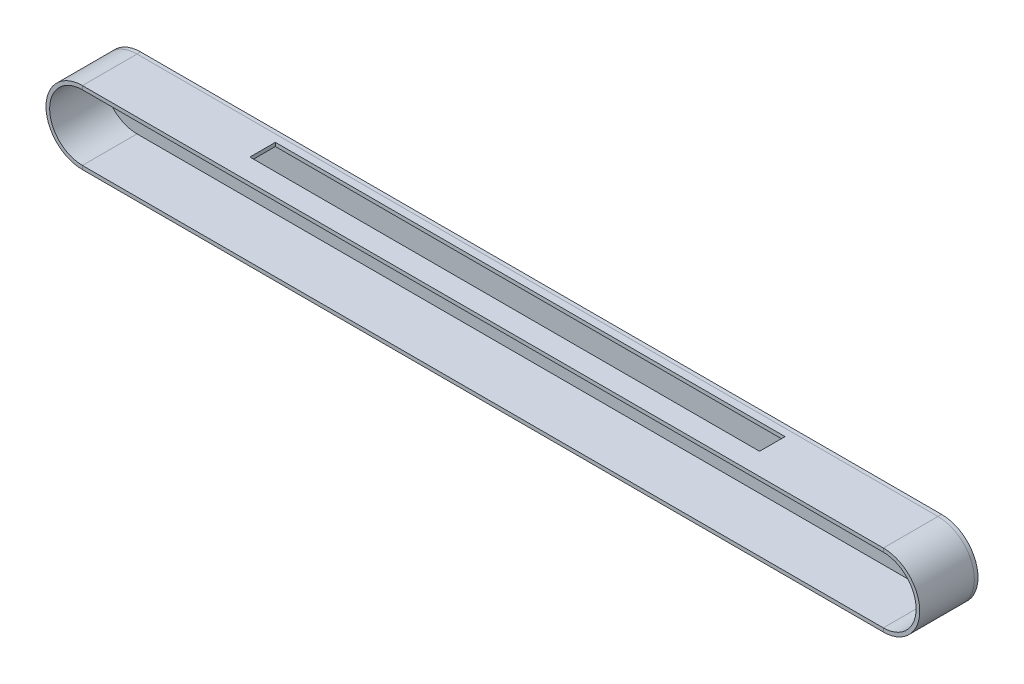
ISO-10303-21;
HEADER;
FILE_DESCRIPTION(('STEP AP214'),'2;1');
FILE_NAME('part.step','',(''),(''),'','','');
FILE_SCHEMA(('AUTOMOTIVE_DESIGN { 1 0 10303 214 1 1 1 1 }'));
ENDSEC;
DATA;
#1=APPLICATION_CONTEXT('core data for automotive mechanical design processes');
#2=APPLICATION_PROTOCOL_DEFINITION('international standard','automotive_design',2000,#1);
#3=PRODUCT_CONTEXT('',#1,'mechanical');
#4=PRODUCT('Part','Part','',(#3));
#5=PRODUCT_RELATED_PRODUCT_CATEGORY('part','',(#4));
#6=PRODUCT_DEFINITION_FORMATION('','',#4);
#7=PRODUCT_DEFINITION_CONTEXT('part definition',#1,'design');
#8=PRODUCT_DEFINITION('design','',#6,#7);
#9=PRODUCT_DEFINITION_SHAPE('','',#8);
#10=(LENGTH_UNIT() NAMED_UNIT(*) SI_UNIT(.MILLI.,.METRE.));
#11=(NAMED_UNIT(*) PLANE_ANGLE_UNIT() SI_UNIT($,.RADIAN.));
#12=(NAMED_UNIT(*) SI_UNIT($,.STERADIAN.) SOLID_ANGLE_UNIT());
#13=UNCERTAINTY_MEASURE_WITH_UNIT(LENGTH_MEASURE(1.E-05),#10,'distance_accuracy_value','');
#14=(GEOMETRIC_REPRESENTATION_CONTEXT(3) GLOBAL_UNCERTAINTY_ASSIGNED_CONTEXT((#13)) GLOBAL_UNIT_ASSIGNED_CONTEXT((#10,
#11,#12)) REPRESENTATION_CONTEXT('',''));
#15=CARTESIAN_POINT('',(0.,0.,0.));
#16=DIRECTION('',(0.,0.,1.));
#17=DIRECTION('',(1.,0.,0.));
#18=AXIS2_PLACEMENT_3D('',#15,#16,#17);
#19=CARTESIAN_POINT('',(-502.733741957931,0.,0.));
#20=DIRECTION('',(0.,0.,1.));
#21=DIRECTION('',(1.,0.,0.));
#22=AXIS2_PLACEMENT_3D('',#19,#20,#21);
#23=PLANE('',#22);
#24=DIRECTION('',(-1.,0.,0.));
#25=VECTOR('',#24,1.);
#26=CARTESIAN_POINT('',(-502.733741957931,25.,0.));
#27=LINE('',#26,#25);
#28=CARTESIAN_POINT('',(-352.733741957931,25.,0.));
#29=VERTEX_POINT('',#28);
#30=CARTESIAN_POINT('',(-452.733741957932,25.,0.));
#31=VERTEX_POINT('',#30);
#32=EDGE_CURVE('E214',#29,#31,#27,.T.);
#33=ORIENTED_EDGE('',*,*,#32,.T.);
#34=DIRECTION('',(0.,-1.,0.));
#35=VECTOR('',#34,1.);
#36=CARTESIAN_POINT('',(-452.733741957932,0.,0.));
#37=LINE('',#36,#35);
#38=CARTESIAN_POINT('',(-452.733741957932,-25.,0.));
#39=VERTEX_POINT('',#38);
#40=EDGE_CURVE('E217',#31,#39,#37,.T.);
#41=ORIENTED_EDGE('',*,*,#40,.T.);
#42=DIRECTION('',(1.,0.,0.));
#43=VECTOR('',#42,1.);
#44=CARTESIAN_POINT('',(-502.733741957931,-25.,0.));
#45=LINE('',#44,#43);
#46=CARTESIAN_POINT('',(-352.733741957931,-25.,0.));
#47=VERTEX_POINT('',#46);
#48=EDGE_CURVE('E211',#39,#47,#45,.T.);
#49=ORIENTED_EDGE('',*,*,#48,.T.);
#50=DIRECTION('',(0.,1.,0.));
#51=VECTOR('',#50,1.);
#52=CARTESIAN_POINT('',(-352.733741957931,0.,0.));
#53=LINE('',#52,#51);
#54=EDGE_CURVE('E156',#47,#29,#53,.T.);
#55=ORIENTED_EDGE('',*,*,#54,.T.);
#56=EDGE_LOOP('',(#33,#41,#49,#55));
#57=FACE_BOUND('',#56,.T.);
#58=DIRECTION('',(-1.,0.,0.));
#59=VECTOR('',#58,1.);
#60=CARTESIAN_POINT('',(-502.733741957931,25.0000000000004,0.));
#61=LINE('',#60,#59);
#62=CARTESIAN_POINT('',(547.266258042068,25.,0.));
#63=VERTEX_POINT('',#62);
#64=CARTESIAN_POINT('',(447.266258042068,25.,0.));
#65=VERTEX_POINT('',#64);
#66=EDGE_CURVE('E205',#63,#65,#61,.T.);
#67=ORIENTED_EDGE('',*,*,#66,.T.);
#68=DIRECTION('',(0.,-1.,0.));
#69=VECTOR('',#68,1.);
#70=CARTESIAN_POINT('',(447.266258042068,0.,0.));
#71=LINE('',#70,#69);
#72=CARTESIAN_POINT('',(447.266258042068,-25.,0.));
#73=VERTEX_POINT('',#72);
#74=EDGE_CURVE('E208',#65,#73,#71,.T.);
#75=ORIENTED_EDGE('',*,*,#74,.T.);
#76=DIRECTION('',(1.,0.,0.));
#77=VECTOR('',#76,1.);
#78=CARTESIAN_POINT('',(-502.733741957931,-25.,0.));
#79=LINE('',#78,#77);
#80=CARTESIAN_POINT('',(547.266258042068,-25.,0.));
#81=VERTEX_POINT('',#80);
#82=EDGE_CURVE('E179',#73,#81,#79,.T.);
#83=ORIENTED_EDGE('',*,*,#82,.T.);
#84=DIRECTION('',(0.,1.,0.));
#85=VECTOR('',#84,1.);
#86=CARTESIAN_POINT('',(547.266258042068,0.,0.));
#87=LINE('',#86,#85);
#88=EDGE_CURVE('E202',#81,#63,#87,.T.);
#89=ORIENTED_EDGE('',*,*,#88,.T.);
#90=EDGE_LOOP('',(#67,#75,#83,#89));
#91=FACE_BOUND('',#90,.T.);
#92=CARTESIAN_POINT('',(-502.733741957931,0.,0.));
#93=DIRECTION('',(0.,0.,1.));
#94=DIRECTION('',(1.,0.,0.));
#95=AXIS2_PLACEMENT_3D('',#92,#93,#94);
#96=CIRCLE('',#95,50.);
#97=CARTESIAN_POINT('',(-502.733741957931,50.,0.));
#98=VERTEX_POINT('',#97);
#99=CARTESIAN_POINT('',(-502.733741957931,-50.,0.));
#100=VERTEX_POINT('',#99);
#101=EDGE_CURVE('E241',#98,#100,#96,.T.);
#102=ORIENTED_EDGE('',*,*,#101,.F.);
#103=DIRECTION('',(-1.,0.,0.));
#104=VECTOR('',#103,1.);
#105=CARTESIAN_POINT('',(-502.733741957931,50.,0.));
#106=LINE('',#105,#104);
#107=CARTESIAN_POINT('',(597.266258042068,50.,0.));
#108=VERTEX_POINT('',#107);
#109=EDGE_CURVE('E226',#108,#98,#106,.T.);
#110=ORIENTED_EDGE('',*,*,#109,.F.);
#111=CARTESIAN_POINT('',(597.266258042068,0.,0.));
#112=DIRECTION('',(0.,0.,1.));
#113=DIRECTION('',(1.,0.,0.));
#114=AXIS2_PLACEMENT_3D('',#111,#112,#113);
#115=CIRCLE('',#114,50.);
#116=CARTESIAN_POINT('',(597.266258042068,-50.,0.));
#117=VERTEX_POINT('',#116);
#118=EDGE_CURVE('E235',#117,#108,#115,.T.);
#119=ORIENTED_EDGE('',*,*,#118,.F.);
#120=DIRECTION('',(1.,0.,0.));
#121=VECTOR('',#120,1.);
#122=CARTESIAN_POINT('',(-502.733741957931,-50.,0.));
#123=LINE('',#122,#121);
#124=EDGE_CURVE('E13',#100,#117,#123,.T.);
#125=ORIENTED_EDGE('',*,*,#124,.F.);
#126=EDGE_LOOP('',(#102,#110,#119,#125));
#127=FACE_BOUND('',#126,.T.);
#128=ADVANCED_FACE('F61',(#57,#91,#127),#23,.F.);
#129=CARTESIAN_POINT('',(-502.733741957931,-50.,80.));
#130=DIRECTION('',(0.,1.,0.));
#131=DIRECTION('',(0.,0.,1.));
#132=AXIS2_PLACEMENT_3D('',#129,#130,#131);
#133=PLANE('',#132);
#134=DIRECTION('',(0.,0.,-1.));
#135=VECTOR('',#134,1.);
#136=CARTESIAN_POINT('',(597.266258042068,-50.,80.));
#137=LINE('',#136,#135);
#138=CARTESIAN_POINT('',(597.266258042068,-50.,5.));
#139=VERTEX_POINT('',#138);
#140=EDGE_CURVE('E236',#139,#117,#137,.T.);
#141=ORIENTED_EDGE('',*,*,#140,.F.);
#142=DIRECTION('',(-1.,0.,0.));
#143=VECTOR('',#142,1.);
#144=CARTESIAN_POINT('',(-502.733741957931,-50.,5.));
#145=LINE('',#144,#143);
#146=CARTESIAN_POINT('',(-502.733741957931,-50.,5.));
#147=VERTEX_POINT('',#146);
#148=EDGE_CURVE('E232',#139,#147,#145,.T.);
#149=ORIENTED_EDGE('',*,*,#148,.T.);
#150=DIRECTION('',(0.,0.,-1.));
#151=VECTOR('',#150,1.);
#152=CARTESIAN_POINT('',(-502.733741957931,-50.,80.));
#153=LINE('',#152,#151);
#154=EDGE_CURVE('E239',#147,#100,#153,.T.);
#155=ORIENTED_EDGE('',*,*,#154,.T.);
#156=ORIENTED_EDGE('',*,*,#124,.T.);
#157=EDGE_LOOP('',(#141,#149,#155,#156));
#158=FACE_BOUND('',#157,.T.);
#159=ADVANCED_FACE('F251',(#158),#133,.F.);
#160=CARTESIAN_POINT('',(-502.733741957931,0.,80.));
#161=DIRECTION('',(0.,0.,-1.));
#162=DIRECTION('',(-1.,0.,0.));
#163=AXIS2_PLACEMENT_3D('',#160,#161,#162);
#164=CYLINDRICAL_SURFACE('',#163,50.);
#165=CARTESIAN_POINT('',(-502.733741957931,0.,5.));
#166=DIRECTION('',(0.,0.,1.));
#167=DIRECTION('',(1.,0.,0.));
#168=AXIS2_PLACEMENT_3D('',#165,#166,#167);
#169=CIRCLE('',#168,50.);
#170=CARTESIAN_POINT('',(-502.733741957931,50.,5.));
#171=VERTEX_POINT('',#170);
#172=EDGE_CURVE('E65',#171,#147,#169,.T.);
#173=ORIENTED_EDGE('',*,*,#172,.F.);
#174=DIRECTION('',(0.,0.,-1.));
#175=VECTOR('',#174,1.);
#176=CARTESIAN_POINT('',(-502.733741957931,50.,80.));
#177=LINE('',#176,#175);
#178=EDGE_CURVE('E223',#171,#98,#177,.T.);
#179=ORIENTED_EDGE('',*,*,#178,.T.);
#180=ORIENTED_EDGE('',*,*,#101,.T.);
#181=ORIENTED_EDGE('',*,*,#154,.F.);
#182=EDGE_LOOP('',(#173,#179,#180,#181));
#183=FACE_BOUND('',#182,.T.);
#184=ADVANCED_FACE('F254',(#183),#164,.T.);
#185=CARTESIAN_POINT('',(597.266258042068,0.,80.));
#186=DIRECTION('',(0.,0.,-1.));
#187=DIRECTION('',(-1.,0.,0.));
#188=AXIS2_PLACEMENT_3D('',#185,#186,#187);
#189=CYLINDRICAL_SURFACE('',#188,50.);
#190=ORIENTED_EDGE('',*,*,#118,.T.);
#191=DIRECTION('',(0.,0.,-1.));
#192=VECTOR('',#191,1.);
#193=CARTESIAN_POINT('',(597.266258042068,50.,80.));
#194=LINE('',#193,#192);
#195=CARTESIAN_POINT('',(597.266258042068,50.,5.));
#196=VERTEX_POINT('',#195);
#197=EDGE_CURVE('E220',#196,#108,#194,.T.);
#198=ORIENTED_EDGE('',*,*,#197,.F.);
#199=CARTESIAN_POINT('',(597.266258042068,0.,5.));
#200=DIRECTION('',(0.,0.,1.));
#201=DIRECTION('',(1.,0.,0.));
#202=AXIS2_PLACEMENT_3D('',#199,#200,#201);
#203=CIRCLE('',#202,50.);
#204=EDGE_CURVE('E238',#139,#196,#203,.T.);
#205=ORIENTED_EDGE('',*,*,#204,.F.);
#206=ORIENTED_EDGE('',*,*,#140,.T.);
#207=EDGE_LOOP('',(#190,#198,#205,#206));
#208=FACE_BOUND('',#207,.T.);
#209=ADVANCED_FACE('F256',(#208),#189,.T.);
#210=CARTESIAN_POINT('',(597.266258042068,-45.,5.));
#211=DIRECTION('',(0.,0.,1.));
#212=DIRECTION('',(1.,0.,0.));
#213=AXIS2_PLACEMENT_3D('',#210,#211,#212);
#214=PLANE('',#213);
#215=DIRECTION('',(0.,-1.,0.));
#216=VECTOR('',#215,1.);
#217=CARTESIAN_POINT('',(-452.733741957932,25.,5.));
#218=LINE('',#217,#216);
#219=CARTESIAN_POINT('',(-452.733741957932,25.,5.));
#220=VERTEX_POINT('',#219);
#221=CARTESIAN_POINT('',(-452.733741957931,-25.,5.));
#222=VERTEX_POINT('',#221);
#223=EDGE_CURVE('E168',#220,#222,#218,.T.);
#224=ORIENTED_EDGE('',*,*,#223,.F.);
#225=DIRECTION('',(-1.,0.,0.));
#226=VECTOR('',#225,1.);
#227=CARTESIAN_POINT('',(-452.733741957932,25.,5.));
#228=LINE('',#227,#226);
#229=CARTESIAN_POINT('',(-352.733741957931,25.,5.));
#230=VERTEX_POINT('',#229);
#231=EDGE_CURVE('E172',#230,#220,#228,.T.);
#232=ORIENTED_EDGE('',*,*,#231,.F.);
#233=DIRECTION('',(0.,1.,0.));
#234=VECTOR('',#233,1.);
#235=CARTESIAN_POINT('',(-352.733741957931,25.,5.));
#236=LINE('',#235,#234);
#237=CARTESIAN_POINT('',(-352.733741957931,-25.,5.));
#238=VERTEX_POINT('',#237);
#239=EDGE_CURVE('E153',#238,#230,#236,.T.);
#240=ORIENTED_EDGE('',*,*,#239,.F.);
#241=DIRECTION('',(1.,0.,0.));
#242=VECTOR('',#241,1.);
#243=CARTESIAN_POINT('',(-452.733741957932,-25.,5.));
#244=LINE('',#243,#242);
#245=EDGE_CURVE('E163',#222,#238,#244,.T.);
#246=ORIENTED_EDGE('',*,*,#245,.F.);
#247=EDGE_LOOP('',(#224,#232,#240,#246));
#248=FACE_BOUND('',#247,.T.);
#249=DIRECTION('',(0.,-1.,0.));
#250=VECTOR('',#249,1.);
#251=CARTESIAN_POINT('',(447.266258042068,25.,5.));
#252=LINE('',#251,#250);
#253=CARTESIAN_POINT('',(447.266258042068,25.,5.));
#254=VERTEX_POINT('',#253);
#255=CARTESIAN_POINT('',(447.266258042068,-25.,5.));
#256=VERTEX_POINT('',#255);
#257=EDGE_CURVE('E182',#254,#256,#252,.T.);
#258=ORIENTED_EDGE('',*,*,#257,.F.);
#259=DIRECTION('',(-1.,0.,0.));
#260=VECTOR('',#259,1.);
#261=CARTESIAN_POINT('',(447.266258042068,25.,5.));
#262=LINE('',#261,#260);
#263=CARTESIAN_POINT('',(547.266258042068,25.,5.));
#264=VERTEX_POINT('',#263);
#265=EDGE_CURVE('E189',#264,#254,#262,.T.);
#266=ORIENTED_EDGE('',*,*,#265,.F.);
#267=DIRECTION('',(0.,1.,0.));
#268=VECTOR('',#267,1.);
#269=CARTESIAN_POINT('',(547.266258042068,25.,5.));
#270=LINE('',#269,#268);
#271=CARTESIAN_POINT('',(547.266258042068,-25.,5.));
#272=VERTEX_POINT('',#271);
#273=EDGE_CURVE('E186',#272,#264,#270,.T.);
#274=ORIENTED_EDGE('',*,*,#273,.F.);
#275=DIRECTION('',(1.,0.,0.));
#276=VECTOR('',#275,1.);
#277=CARTESIAN_POINT('',(447.266258042068,-25.,5.));
#278=LINE('',#277,#276);
#279=EDGE_CURVE('E184',#256,#272,#278,.T.);
#280=ORIENTED_EDGE('',*,*,#279,.F.);
#281=EDGE_LOOP('',(#258,#266,#274,#280));
#282=FACE_BOUND('',#281,.T.);
#283=ORIENTED_EDGE('',*,*,#204,.T.);
#284=DIRECTION('',(1.,0.,0.));
#285=VECTOR('',#284,1.);
#286=CARTESIAN_POINT('',(-502.733741957931,50.,5.));
#287=LINE('',#286,#285);
#288=EDGE_CURVE('E229',#171,#196,#287,.T.);
#289=ORIENTED_EDGE('',*,*,#288,.F.);
#290=ORIENTED_EDGE('',*,*,#172,.T.);
#291=ORIENTED_EDGE('',*,*,#148,.F.);
#292=EDGE_LOOP('',(#283,#289,#290,#291));
#293=FACE_BOUND('',#292,.T.);
#294=ADVANCED_FACE('F63',(#248,#282,#293),#214,.T.);
#295=CARTESIAN_POINT('',(-502.733741957931,50.,80.));
#296=DIRECTION('',(0.,-1.,0.));
#297=DIRECTION('',(0.,0.,-1.));
#298=AXIS2_PLACEMENT_3D('',#295,#296,#297);
#299=PLANE('',#298);
#300=ORIENTED_EDGE('',*,*,#178,.F.);
#301=ORIENTED_EDGE('',*,*,#288,.T.);
#302=ORIENTED_EDGE('',*,*,#197,.T.);
#303=ORIENTED_EDGE('',*,*,#109,.T.);
#304=EDGE_LOOP('',(#300,#301,#302,#303));
#305=FACE_BOUND('',#304,.T.);
#306=ADVANCED_FACE('F274',(#305),#299,.F.);
#307=CARTESIAN_POINT('',(447.266258042068,25.,-5.));
#308=DIRECTION('',(-1.,0.,0.));
#309=DIRECTION('',(0.,0.,1.));
#310=AXIS2_PLACEMENT_3D('',#307,#308,#309);
#311=PLANE('',#310);
#312=DIRECTION('',(0.,0.,1.));
#313=VECTOR('',#312,1.);
#314=CARTESIAN_POINT('',(447.266258042068,25.,-5.));
#315=LINE('',#314,#313);
#316=EDGE_CURVE('E193',#65,#254,#315,.T.);
#317=ORIENTED_EDGE('',*,*,#316,.T.);
#318=ORIENTED_EDGE('',*,*,#257,.T.);
#319=DIRECTION('',(0.,0.,1.));
#320=VECTOR('',#319,1.);
#321=CARTESIAN_POINT('',(447.266258042068,-25.,-5.));
#322=LINE('',#321,#320);
#323=EDGE_CURVE('E192',#73,#256,#322,.T.);
#324=ORIENTED_EDGE('',*,*,#323,.F.);
#325=ORIENTED_EDGE('',*,*,#74,.F.);
#326=EDGE_LOOP('',(#317,#318,#324,#325));
#327=FACE_BOUND('',#326,.T.);
#328=ADVANCED_FACE('F277',(#327),#311,.F.);
#329=CARTESIAN_POINT('',(447.266258042068,25.,-5.));
#330=DIRECTION('',(0.,1.,0.));
#331=DIRECTION('',(-1.,0.,0.));
#332=AXIS2_PLACEMENT_3D('',#329,#330,#331);
#333=PLANE('',#332);
#334=DIRECTION('',(0.,0.,1.));
#335=VECTOR('',#334,1.);
#336=CARTESIAN_POINT('',(547.266258042068,25.,-5.));
#337=LINE('',#336,#335);
#338=EDGE_CURVE('E195',#63,#264,#337,.T.);
#339=ORIENTED_EDGE('',*,*,#338,.T.);
#340=ORIENTED_EDGE('',*,*,#265,.T.);
#341=ORIENTED_EDGE('',*,*,#316,.F.);
#342=ORIENTED_EDGE('',*,*,#66,.F.);
#343=EDGE_LOOP('',(#339,#340,#341,#342));
#344=FACE_BOUND('',#343,.T.);
#345=ADVANCED_FACE('F283',(#344),#333,.F.);
#346=CARTESIAN_POINT('',(547.266258042068,25.,-5.));
#347=DIRECTION('',(1.,0.,0.));
#348=DIRECTION('',(0.,0.,-1.));
#349=AXIS2_PLACEMENT_3D('',#346,#347,#348);
#350=PLANE('',#349);
#351=DIRECTION('',(0.,0.,1.));
#352=VECTOR('',#351,1.);
#353=CARTESIAN_POINT('',(547.266258042068,-25.,-5.));
#354=LINE('',#353,#352);
#355=EDGE_CURVE('E85',#81,#272,#354,.T.);
#356=ORIENTED_EDGE('',*,*,#355,.T.);
#357=ORIENTED_EDGE('',*,*,#273,.T.);
#358=ORIENTED_EDGE('',*,*,#338,.F.);
#359=ORIENTED_EDGE('',*,*,#88,.F.);
#360=EDGE_LOOP('',(#356,#357,#358,#359));
#361=FACE_BOUND('',#360,.T.);
#362=ADVANCED_FACE('F291',(#361),#350,.F.);
#363=CARTESIAN_POINT('',(447.266258042068,-25.,-5.));
#364=DIRECTION('',(0.,-1.,0.));
#365=DIRECTION('',(0.,0.,-1.));
#366=AXIS2_PLACEMENT_3D('',#363,#364,#365);
#367=PLANE('',#366);
#368=ORIENTED_EDGE('',*,*,#323,.T.);
#369=ORIENTED_EDGE('',*,*,#279,.T.);
#370=ORIENTED_EDGE('',*,*,#355,.F.);
#371=ORIENTED_EDGE('',*,*,#82,.F.);
#372=EDGE_LOOP('',(#368,#369,#370,#371));
#373=FACE_BOUND('',#372,.T.);
#374=ADVANCED_FACE('F287',(#373),#367,.F.);
#375=CARTESIAN_POINT('',(-452.733741957932,25.,-5.));
#376=DIRECTION('',(-1.,0.,0.));
#377=DIRECTION('',(0.,0.,1.));
#378=AXIS2_PLACEMENT_3D('',#375,#376,#377);
#379=PLANE('',#378);
#380=DIRECTION('',(0.,0.,1.));
#381=VECTOR('',#380,1.);
#382=CARTESIAN_POINT('',(-452.733741957932,25.,-5.));
#383=LINE('',#382,#381);
#384=EDGE_CURVE('E177',#31,#220,#383,.T.);
#385=ORIENTED_EDGE('',*,*,#384,.T.);
#386=ORIENTED_EDGE('',*,*,#223,.T.);
#387=DIRECTION('',(0.,0.,1.));
#388=VECTOR('',#387,1.);
#389=CARTESIAN_POINT('',(-452.733741957932,-25.,-5.));
#390=LINE('',#389,#388);
#391=EDGE_CURVE('E159',#39,#222,#390,.T.);
#392=ORIENTED_EDGE('',*,*,#391,.F.);
#393=ORIENTED_EDGE('',*,*,#40,.F.);
#394=EDGE_LOOP('',(#385,#386,#392,#393));
#395=FACE_BOUND('',#394,.T.);
#396=ADVANCED_FACE('F290',(#395),#379,.F.);
#397=CARTESIAN_POINT('',(-452.733741957932,25.,-5.));
#398=DIRECTION('',(0.,1.,0.));
#399=DIRECTION('',(0.,0.,1.));
#400=AXIS2_PLACEMENT_3D('',#397,#398,#399);
#401=PLANE('',#400);
#402=DIRECTION('',(0.,0.,1.));
#403=VECTOR('',#402,1.);
#404=CARTESIAN_POINT('',(-352.733741957931,25.,-5.));
#405=LINE('',#404,#403);
#406=EDGE_CURVE('E158',#29,#230,#405,.T.);
#407=ORIENTED_EDGE('',*,*,#406,.T.);
#408=ORIENTED_EDGE('',*,*,#231,.T.);
#409=ORIENTED_EDGE('',*,*,#384,.F.);
#410=ORIENTED_EDGE('',*,*,#32,.F.);
#411=EDGE_LOOP('',(#407,#408,#409,#410));
#412=FACE_BOUND('',#411,.T.);
#413=ADVANCED_FACE('F300',(#412),#401,.F.);
#414=CARTESIAN_POINT('',(-352.733741957931,25.,-5.));
#415=DIRECTION('',(1.,0.,0.));
#416=DIRECTION('',(0.,0.,-1.));
#417=AXIS2_PLACEMENT_3D('',#414,#415,#416);
#418=PLANE('',#417);
#419=DIRECTION('',(0.,0.,1.));
#420=VECTOR('',#419,1.);
#421=CARTESIAN_POINT('',(-352.733741957931,-25.,-5.));
#422=LINE('',#421,#420);
#423=EDGE_CURVE('E77',#47,#238,#422,.T.);
#424=ORIENTED_EDGE('',*,*,#423,.T.);
#425=ORIENTED_EDGE('',*,*,#239,.T.);
#426=ORIENTED_EDGE('',*,*,#406,.F.);
#427=ORIENTED_EDGE('',*,*,#54,.F.);
#428=EDGE_LOOP('',(#424,#425,#426,#427));
#429=FACE_BOUND('',#428,.T.);
#430=ADVANCED_FACE('F150',(#429),#418,.F.);
#431=CARTESIAN_POINT('',(-452.733741957932,-25.,-5.));
#432=DIRECTION('',(0.,-1.,0.));
#433=DIRECTION('',(0.,0.,-1.));
#434=AXIS2_PLACEMENT_3D('',#431,#432,#433);
#435=PLANE('',#434);
#436=ORIENTED_EDGE('',*,*,#391,.T.);
#437=ORIENTED_EDGE('',*,*,#245,.T.);
#438=ORIENTED_EDGE('',*,*,#423,.F.);
#439=ORIENTED_EDGE('',*,*,#48,.F.);
#440=EDGE_LOOP('',(#436,#437,#438,#439));
#441=FACE_BOUND('',#440,.T.);
#442=ADVANCED_FACE('F164',(#441),#435,.F.);
#443=CLOSED_SHELL('',(#128,#159,#184,#209,#294,#306,#328,#345,#362,#374,#396,#413,#430,#442));
#444=MANIFOLD_SOLID_BREP('B2',#443);
#445=CARTESIAN_POINT('',(0.,0.,5.));
#446=DIRECTION('',(0.,0.,-1.));
#447=DIRECTION('',(-1.,0.,0.));
#448=AXIS2_PLACEMENT_3D('',#445,#446,#447);
#449=PLANE('',#448);
#450=DIRECTION('',(-1.,0.,0.));
#451=VECTOR('',#450,1.);
#452=CARTESIAN_POINT('',(-502.733741957931,-50.,5.));
#453=LINE('',#452,#451);
#454=CARTESIAN_POINT('',(597.266258042068,-50.,5.));
#455=VERTEX_POINT('',#454);
#456=CARTESIAN_POINT('',(-502.733741957931,-50.,5.));
#457=VERTEX_POINT('',#456);
#458=EDGE_CURVE('E481',#455,#457,#453,.T.);
#459=ORIENTED_EDGE('',*,*,#458,.T.);
#460=DIRECTION('',(0.,1.,0.));
#461=VECTOR('',#460,1.);
#462=CARTESIAN_POINT('',(-502.733741957931,0.,5.));
#463=LINE('',#462,#461);
#464=CARTESIAN_POINT('',(-502.733741957931,-45.,5.));
#465=VERTEX_POINT('',#464);
#466=EDGE_CURVE('E438',#457,#465,#463,.T.);
#467=ORIENTED_EDGE('',*,*,#466,.T.);
#468=DIRECTION('',(-1.,0.,0.));
#469=VECTOR('',#468,1.);
#470=CARTESIAN_POINT('',(-502.733741957931,-45.,5.));
#471=LINE('',#470,#469);
#472=CARTESIAN_POINT('',(597.266258042068,-45.,5.));
#473=VERTEX_POINT('',#472);
#474=EDGE_CURVE('E489',#473,#465,#471,.T.);
#475=ORIENTED_EDGE('',*,*,#474,.F.);
#476=DIRECTION('',(0.,1.,0.));
#477=VECTOR('',#476,1.);
#478=CARTESIAN_POINT('',(597.266258042068,0.,5.));
#479=LINE('',#478,#477);
#480=EDGE_CURVE('E488',#455,#473,#479,.T.);
#481=ORIENTED_EDGE('',*,*,#480,.F.);
#482=EDGE_LOOP('',(#459,#467,#475,#481));
#483=FACE_BOUND('',#482,.T.);
#484=ADVANCED_FACE('F434',(#483),#449,.T.);
#485=CARTESIAN_POINT('',(-502.733741957931,-50.,80.));
#486=DIRECTION('',(0.,1.,0.));
#487=DIRECTION('',(0.,0.,1.));
#488=AXIS2_PLACEMENT_3D('',#485,#486,#487);
#489=PLANE('',#488);
#490=ORIENTED_EDGE('',*,*,#458,.F.);
#491=DIRECTION('',(0.,0.,-1.));
#492=VECTOR('',#491,1.);
#493=CARTESIAN_POINT('',(597.266258042068,-50.,80.));
#494=LINE('',#493,#492);
#495=CARTESIAN_POINT('',(597.266258042068,-50.,80.));
#496=VERTEX_POINT('',#495);
#497=EDGE_CURVE('E59',#496,#455,#494,.T.);
#498=ORIENTED_EDGE('',*,*,#497,.F.);
#499=DIRECTION('',(1.,0.,0.));
#500=VECTOR('',#499,1.);
#501=CARTESIAN_POINT('',(-502.733741957931,-50.,80.));
#502=LINE('',#501,#500);
#503=CARTESIAN_POINT('',(-502.733741957931,-50.,80.));
#504=VERTEX_POINT('',#503);
#505=EDGE_CURVE('E451',#504,#496,#502,.T.);
#506=ORIENTED_EDGE('',*,*,#505,.F.);
#507=DIRECTION('',(0.,0.,-1.));
#508=VECTOR('',#507,1.);
#509=CARTESIAN_POINT('',(-502.733741957931,-50.,80.));
#510=LINE('',#509,#508);
#511=EDGE_CURVE('E477',#504,#457,#510,.T.);
#512=ORIENTED_EDGE('',*,*,#511,.T.);
#513=EDGE_LOOP('',(#490,#498,#506,#512));
#514=FACE_BOUND('',#513,.T.);
#515=ADVANCED_FACE('F479',(#514),#489,.F.);
#516=CARTESIAN_POINT('',(-502.733741957931,0.,80.));
#517=DIRECTION('',(0.,0.,1.));
#518=DIRECTION('',(1.,0.,0.));
#519=AXIS2_PLACEMENT_3D('',#516,#517,#518);
#520=PLANE('',#519);
#521=DIRECTION('',(0.,1.,0.));
#522=VECTOR('',#521,1.);
#523=CARTESIAN_POINT('',(-502.733741957931,0.,80.));
#524=LINE('',#523,#522);
#525=CARTESIAN_POINT('',(-502.733741957931,-45.,80.));
#526=VERTEX_POINT('',#525);
#527=EDGE_CURVE('E456',#504,#526,#524,.T.);
#528=ORIENTED_EDGE('',*,*,#527,.F.);
#529=ORIENTED_EDGE('',*,*,#505,.T.);
#530=DIRECTION('',(0.,1.,0.));
#531=VECTOR('',#530,1.);
#532=CARTESIAN_POINT('',(597.266258042068,0.,80.));
#533=LINE('',#532,#531);
#534=CARTESIAN_POINT('',(597.266258042068,-45.,80.));
#535=VERTEX_POINT('',#534);
#536=EDGE_CURVE('E443',#496,#535,#533,.T.);
#537=ORIENTED_EDGE('',*,*,#536,.T.);
#538=DIRECTION('',(1.,0.,0.));
#539=VECTOR('',#538,1.);
#540=CARTESIAN_POINT('',(-502.733741957931,-45.,80.));
#541=LINE('',#540,#539);
#542=EDGE_CURVE('E502',#526,#535,#541,.T.);
#543=ORIENTED_EDGE('',*,*,#542,.F.);
#544=EDGE_LOOP('',(#528,#529,#537,#543));
#545=FACE_BOUND('',#544,.T.);
#546=ADVANCED_FACE('F506',(#545),#520,.T.);
#547=CARTESIAN_POINT('',(-502.733741957931,0.,0.));
#548=DIRECTION('',(1.,0.,0.));
#549=DIRECTION('',(0.,0.,-1.));
#550=AXIS2_PLACEMENT_3D('',#547,#548,#549);
#551=PLANE('',#550);
#552=ORIENTED_EDGE('',*,*,#466,.F.);
#553=ORIENTED_EDGE('',*,*,#511,.F.);
#554=ORIENTED_EDGE('',*,*,#527,.T.);
#555=DIRECTION('',(0.,0.,1.));
#556=VECTOR('',#555,1.);
#557=CARTESIAN_POINT('',(-502.733741957931,-45.,80.));
#558=LINE('',#557,#556);
#559=EDGE_CURVE('E491',#526,#465,#558,.F.);
#560=ORIENTED_EDGE('',*,*,#559,.T.);
#561=EDGE_LOOP('',(#552,#553,#554,#560));
#562=FACE_BOUND('',#561,.T.);
#563=ADVANCED_FACE('F490',(#562),#551,.F.);
#564=CARTESIAN_POINT('',(597.266258042068,0.,0.));
#565=DIRECTION('',(1.,0.,0.));
#566=DIRECTION('',(0.,0.,-1.));
#567=AXIS2_PLACEMENT_3D('',#564,#565,#566);
#568=PLANE('',#567);
#569=ORIENTED_EDGE('',*,*,#497,.T.);
#570=ORIENTED_EDGE('',*,*,#480,.T.);
#571=DIRECTION('',(0.,0.,-1.));
#572=VECTOR('',#571,1.);
#573=CARTESIAN_POINT('',(597.266258042068,-45.,80.));
#574=LINE('',#573,#572);
#575=EDGE_CURVE('E497',#535,#473,#574,.T.);
#576=ORIENTED_EDGE('',*,*,#575,.F.);
#577=ORIENTED_EDGE('',*,*,#536,.F.);
#578=EDGE_LOOP('',(#569,#570,#576,#577));
#579=FACE_BOUND('',#578,.T.);
#580=ADVANCED_FACE('F508',(#579),#568,.T.);
#581=CARTESIAN_POINT('',(-502.733741957931,-45.,80.));
#582=DIRECTION('',(0.,1.,0.));
#583=DIRECTION('',(0.,0.,1.));
#584=AXIS2_PLACEMENT_3D('',#581,#582,#583);
#585=PLANE('',#584);
#586=ORIENTED_EDGE('',*,*,#575,.T.);
#587=ORIENTED_EDGE('',*,*,#474,.T.);
#588=ORIENTED_EDGE('',*,*,#559,.F.);
#589=ORIENTED_EDGE('',*,*,#542,.T.);
#590=EDGE_LOOP('',(#586,#587,#588,#589));
#591=FACE_BOUND('',#590,.T.);
#592=ADVANCED_FACE('F436',(#591),#585,.T.);
#593=CLOSED_SHELL('',(#484,#515,#546,#563,#580,#592));
#594=MANIFOLD_SOLID_BREP('B7',#593);
#595=CARTESIAN_POINT('',(0.,0.,5.));
#596=DIRECTION('',(0.,0.,-1.));
#597=DIRECTION('',(-1.,0.,0.));
#598=AXIS2_PLACEMENT_3D('',#595,#596,#597);
#599=PLANE('',#598);
#600=DIRECTION('',(1.,0.,0.));
#601=VECTOR('',#600,1.);
#602=CARTESIAN_POINT('',(597.266258042068,45.,5.));
#603=LINE('',#602,#601);
#604=CARTESIAN_POINT('',(-502.733741957931,45.,5.));
#605=VERTEX_POINT('',#604);
#606=CARTESIAN_POINT('',(597.266258042068,45.,5.));
#607=VERTEX_POINT('',#606);
#608=EDGE_CURVE('E695',#605,#607,#603,.T.);
#609=ORIENTED_EDGE('',*,*,#608,.F.);
#610=DIRECTION('',(0.,1.,0.));
#611=VECTOR('',#610,1.);
#612=CARTESIAN_POINT('',(-502.733741957931,0.,5.));
#613=LINE('',#612,#611);
#614=CARTESIAN_POINT('',(-502.733741957931,50.,5.));
#615=VERTEX_POINT('',#614);
#616=EDGE_CURVE('E579',#605,#615,#613,.T.);
#617=ORIENTED_EDGE('',*,*,#616,.T.);
#618=DIRECTION('',(1.,0.,0.));
#619=VECTOR('',#618,1.);
#620=CARTESIAN_POINT('',(-502.733741957931,50.,5.));
#621=LINE('',#620,#619);
#622=CARTESIAN_POINT('',(597.266258042068,50.,5.));
#623=VERTEX_POINT('',#622);
#624=EDGE_CURVE('E698',#615,#623,#621,.T.);
#625=ORIENTED_EDGE('',*,*,#624,.T.);
#626=DIRECTION('',(0.,1.,0.));
#627=VECTOR('',#626,1.);
#628=CARTESIAN_POINT('',(597.266258042068,0.,5.));
#629=LINE('',#628,#627);
#630=EDGE_CURVE('E432',#607,#623,#629,.T.);
#631=ORIENTED_EDGE('',*,*,#630,.F.);
#632=EDGE_LOOP('',(#609,#617,#625,#631));
#633=FACE_BOUND('',#632,.T.);
#634=ADVANCED_FACE('F575',(#633),#599,.T.);
#635=CARTESIAN_POINT('',(597.266258042068,45.,5.));
#636=DIRECTION('',(0.,-1.,0.));
#637=DIRECTION('',(0.,0.,-1.));
#638=AXIS2_PLACEMENT_3D('',#635,#636,#637);
#639=PLANE('',#638);
#640=DIRECTION('',(0.,0.,-1.));
#641=VECTOR('',#640,1.);
#642=CARTESIAN_POINT('',(-302.733741957932,45.,5.));
#643=LINE('',#642,#641);
#644=CARTESIAN_POINT('',(-302.733741957931,45.,50.));
#645=VERTEX_POINT('',#644);
#646=CARTESIAN_POINT('',(-302.733741957931,45.,15.));
#647=VERTEX_POINT('',#646);
#648=EDGE_CURVE('E673',#645,#647,#643,.T.);
#649=ORIENTED_EDGE('',*,*,#648,.F.);
#650=DIRECTION('',(-1.,0.,0.));
#651=VECTOR('',#650,1.);
#652=CARTESIAN_POINT('',(597.266258042068,45.,50.));
#653=LINE('',#652,#651);
#654=CARTESIAN_POINT('',(397.266258042068,45.,50.));
#655=VERTEX_POINT('',#654);
#656=EDGE_CURVE('E666',#655,#645,#653,.T.);
#657=ORIENTED_EDGE('',*,*,#656,.F.);
#658=DIRECTION('',(0.,0.,1.));
#659=VECTOR('',#658,1.);
#660=CARTESIAN_POINT('',(397.266258042068,45.,5.));
#661=LINE('',#660,#659);
#662=CARTESIAN_POINT('',(397.266258042068,45.,15.));
#663=VERTEX_POINT('',#662);
#664=EDGE_CURVE('E647',#663,#655,#661,.T.);
#665=ORIENTED_EDGE('',*,*,#664,.F.);
#666=DIRECTION('',(1.,0.,0.));
#667=VECTOR('',#666,1.);
#668=CARTESIAN_POINT('',(597.266258042068,45.,15.));
#669=LINE('',#668,#667);
#670=EDGE_CURVE('E671',#647,#663,#669,.T.);
#671=ORIENTED_EDGE('',*,*,#670,.F.);
#672=EDGE_LOOP('',(#649,#657,#665,#671));
#673=FACE_BOUND('',#672,.T.);
#674=DIRECTION('',(0.,0.,-1.));
#675=VECTOR('',#674,1.);
#676=CARTESIAN_POINT('',(-502.733741957931,45.,80.));
#677=LINE('',#676,#675);
#678=CARTESIAN_POINT('',(-502.733741957931,45.,80.));
#679=VERTEX_POINT('',#678);
#680=EDGE_CURVE('E688',#679,#605,#677,.T.);
#681=ORIENTED_EDGE('',*,*,#680,.T.);
#682=ORIENTED_EDGE('',*,*,#608,.T.);
#683=DIRECTION('',(0.,0.,-1.));
#684=VECTOR('',#683,1.);
#685=CARTESIAN_POINT('',(597.266258042068,45.,80.));
#686=LINE('',#685,#684);
#687=CARTESIAN_POINT('',(597.266258042068,45.,80.));
#688=VERTEX_POINT('',#687);
#689=EDGE_CURVE('E679',#688,#607,#686,.T.);
#690=ORIENTED_EDGE('',*,*,#689,.F.);
#691=DIRECTION('',(-1.,0.,0.));
#692=VECTOR('',#691,1.);
#693=CARTESIAN_POINT('',(-502.733741957931,45.,80.));
#694=LINE('',#693,#692);
#695=EDGE_CURVE('E683',#688,#679,#694,.T.);
#696=ORIENTED_EDGE('',*,*,#695,.T.);
#697=EDGE_LOOP('',(#681,#682,#690,#696));
#698=FACE_BOUND('',#697,.T.);
#699=ADVANCED_FACE('F716',(#673,#698),#639,.T.);
#700=CARTESIAN_POINT('',(597.266258042068,0.,0.));
#701=DIRECTION('',(1.,0.,0.));
#702=DIRECTION('',(0.,0.,-1.));
#703=AXIS2_PLACEMENT_3D('',#700,#701,#702);
#704=PLANE('',#703);
#705=ORIENTED_EDGE('',*,*,#689,.T.);
#706=ORIENTED_EDGE('',*,*,#630,.T.);
#707=DIRECTION('',(0.,0.,-1.));
#708=VECTOR('',#707,1.);
#709=CARTESIAN_POINT('',(597.266258042068,50.,80.));
#710=LINE('',#709,#708);
#711=CARTESIAN_POINT('',(597.266258042068,50.,80.));
#712=VERTEX_POINT('',#711);
#713=EDGE_CURVE('E678',#712,#623,#710,.T.);
#714=ORIENTED_EDGE('',*,*,#713,.F.);
#715=DIRECTION('',(0.,1.,0.));
#716=VECTOR('',#715,1.);
#717=CARTESIAN_POINT('',(597.266258042068,0.,80.));
#718=LINE('',#717,#716);
#719=EDGE_CURVE('E675',#688,#712,#718,.T.);
#720=ORIENTED_EDGE('',*,*,#719,.F.);
#721=EDGE_LOOP('',(#705,#706,#714,#720));
#722=FACE_BOUND('',#721,.T.);
#723=ADVANCED_FACE('F711',(#722),#704,.T.);
#724=CARTESIAN_POINT('',(-502.733741957931,0.,80.));
#725=DIRECTION('',(0.,0.,1.));
#726=DIRECTION('',(1.,0.,0.));
#727=AXIS2_PLACEMENT_3D('',#724,#725,#726);
#728=PLANE('',#727);
#729=DIRECTION('',(0.,1.,0.));
#730=VECTOR('',#729,1.);
#731=CARTESIAN_POINT('',(-502.733741957931,0.,80.));
#732=LINE('',#731,#730);
#733=CARTESIAN_POINT('',(-502.733741957931,50.,80.));
#734=VERTEX_POINT('',#733);
#735=EDGE_CURVE('E680',#679,#734,#732,.T.);
#736=ORIENTED_EDGE('',*,*,#735,.F.);
#737=ORIENTED_EDGE('',*,*,#695,.F.);
#738=ORIENTED_EDGE('',*,*,#719,.T.);
#739=DIRECTION('',(-1.,0.,0.));
#740=VECTOR('',#739,1.);
#741=CARTESIAN_POINT('',(-502.733741957931,50.,80.));
#742=LINE('',#741,#740);
#743=EDGE_CURVE('E685',#712,#734,#742,.T.);
#744=ORIENTED_EDGE('',*,*,#743,.T.);
#745=EDGE_LOOP('',(#736,#737,#738,#744));
#746=FACE_BOUND('',#745,.T.);
#747=ADVANCED_FACE('F714',(#746),#728,.T.);
#748=CARTESIAN_POINT('',(-502.733741957931,0.,0.));
#749=DIRECTION('',(1.,0.,0.));
#750=DIRECTION('',(0.,0.,-1.));
#751=AXIS2_PLACEMENT_3D('',#748,#749,#750);
#752=PLANE('',#751);
#753=ORIENTED_EDGE('',*,*,#616,.F.);
#754=ORIENTED_EDGE('',*,*,#680,.F.);
#755=ORIENTED_EDGE('',*,*,#735,.T.);
#756=DIRECTION('',(0.,0.,-1.));
#757=VECTOR('',#756,1.);
#758=CARTESIAN_POINT('',(-502.733741957931,50.,80.));
#759=LINE('',#758,#757);
#760=EDGE_CURVE('E584',#734,#615,#759,.T.);
#761=ORIENTED_EDGE('',*,*,#760,.T.);
#762=EDGE_LOOP('',(#753,#754,#755,#761));
#763=FACE_BOUND('',#762,.T.);
#764=ADVANCED_FACE('F707',(#763),#752,.F.);
#765=CARTESIAN_POINT('',(-502.733741957931,50.,80.));
#766=DIRECTION('',(0.,-1.,0.));
#767=DIRECTION('',(0.,0.,-1.));
#768=AXIS2_PLACEMENT_3D('',#765,#766,#767);
#769=PLANE('',#768);
#770=DIRECTION('',(1.,0.,0.));
#771=VECTOR('',#770,1.);
#772=CARTESIAN_POINT('',(-302.733741957931,50.,50.));
#773=LINE('',#772,#771);
#774=CARTESIAN_POINT('',(-302.733741957931,50.,50.));
#775=VERTEX_POINT('',#774);
#776=CARTESIAN_POINT('',(397.266258042068,50.,50.));
#777=VERTEX_POINT('',#776);
#778=EDGE_CURVE('E653',#775,#777,#773,.T.);
#779=ORIENTED_EDGE('',*,*,#778,.F.);
#780=DIRECTION('',(0.,0.,1.));
#781=VECTOR('',#780,1.);
#782=CARTESIAN_POINT('',(-302.733741957931,50.,15.));
#783=LINE('',#782,#781);
#784=CARTESIAN_POINT('',(-302.733741957931,50.,15.));
#785=VERTEX_POINT('',#784);
#786=EDGE_CURVE('E600',#785,#775,#783,.T.);
#787=ORIENTED_EDGE('',*,*,#786,.F.);
#788=DIRECTION('',(-1.,0.,0.));
#789=VECTOR('',#788,1.);
#790=CARTESIAN_POINT('',(-302.733741957931,50.,15.));
#791=LINE('',#790,#789);
#792=CARTESIAN_POINT('',(397.266258042068,50.,15.));
#793=VERTEX_POINT('',#792);
#794=EDGE_CURVE('E659',#793,#785,#791,.T.);
#795=ORIENTED_EDGE('',*,*,#794,.F.);
#796=DIRECTION('',(0.,0.,-1.));
#797=VECTOR('',#796,1.);
#798=CARTESIAN_POINT('',(397.266258042068,50.,15.));
#799=LINE('',#798,#797);
#800=EDGE_CURVE('E644',#777,#793,#799,.T.);
#801=ORIENTED_EDGE('',*,*,#800,.F.);
#802=EDGE_LOOP('',(#779,#787,#795,#801));
#803=FACE_BOUND('',#802,.T.);
#804=ORIENTED_EDGE('',*,*,#624,.F.);
#805=ORIENTED_EDGE('',*,*,#760,.F.);
#806=ORIENTED_EDGE('',*,*,#743,.F.);
#807=ORIENTED_EDGE('',*,*,#713,.T.);
#808=EDGE_LOOP('',(#804,#805,#806,#807));
#809=FACE_BOUND('',#808,.T.);
#810=ADVANCED_FACE('F577',(#803,#809),#769,.F.);
#811=CARTESIAN_POINT('',(-302.733741957931,40.,15.));
#812=DIRECTION('',(-1.,0.,0.));
#813=DIRECTION('',(0.,0.,1.));
#814=AXIS2_PLACEMENT_3D('',#811,#812,#813);
#815=PLANE('',#814);
#816=ORIENTED_EDGE('',*,*,#648,.T.);
#817=DIRECTION('',(0.,1.,0.));
#818=VECTOR('',#817,1.);
#819=CARTESIAN_POINT('',(-302.733741957931,40.,15.));
#820=LINE('',#819,#818);
#821=EDGE_CURVE('E664',#647,#785,#820,.T.);
#822=ORIENTED_EDGE('',*,*,#821,.T.);
#823=ORIENTED_EDGE('',*,*,#786,.T.);
#824=DIRECTION('',(0.,1.,0.));
#825=VECTOR('',#824,1.);
#826=CARTESIAN_POINT('',(-302.733741957931,40.,50.));
#827=LINE('',#826,#825);
#828=EDGE_CURVE('E650',#645,#775,#827,.T.);
#829=ORIENTED_EDGE('',*,*,#828,.F.);
#830=EDGE_LOOP('',(#816,#822,#823,#829));
#831=FACE_BOUND('',#830,.T.);
#832=ADVANCED_FACE('F725',(#831),#815,.F.);
#833=CARTESIAN_POINT('',(-302.733741957931,40.,15.));
#834=DIRECTION('',(0.,0.,-1.));
#835=DIRECTION('',(-1.,0.,0.));
#836=AXIS2_PLACEMENT_3D('',#833,#834,#835);
#837=PLANE('',#836);
#838=ORIENTED_EDGE('',*,*,#670,.T.);
#839=DIRECTION('',(0.,1.,0.));
#840=VECTOR('',#839,1.);
#841=CARTESIAN_POINT('',(397.266258042068,40.,15.));
#842=LINE('',#841,#840);
#843=EDGE_CURVE('E649',#663,#793,#842,.T.);
#844=ORIENTED_EDGE('',*,*,#843,.T.);
#845=ORIENTED_EDGE('',*,*,#794,.T.);
#846=ORIENTED_EDGE('',*,*,#821,.F.);
#847=EDGE_LOOP('',(#838,#844,#845,#846));
#848=FACE_BOUND('',#847,.T.);
#849=ADVANCED_FACE('F734',(#848),#837,.F.);
#850=CARTESIAN_POINT('',(397.266258042068,40.,15.));
#851=DIRECTION('',(1.,0.,0.));
#852=DIRECTION('',(0.,0.,-1.));
#853=AXIS2_PLACEMENT_3D('',#850,#851,#852);
#854=PLANE('',#853);
#855=ORIENTED_EDGE('',*,*,#664,.T.);
#856=DIRECTION('',(0.,1.,0.));
#857=VECTOR('',#856,1.);
#858=CARTESIAN_POINT('',(397.266258042068,40.,50.));
#859=LINE('',#858,#857);
#860=EDGE_CURVE('E592',#655,#777,#859,.T.);
#861=ORIENTED_EDGE('',*,*,#860,.T.);
#862=ORIENTED_EDGE('',*,*,#800,.T.);
#863=ORIENTED_EDGE('',*,*,#843,.F.);
#864=EDGE_LOOP('',(#855,#861,#862,#863));
#865=FACE_BOUND('',#864,.T.);
#866=ADVANCED_FACE('F641',(#865),#854,.F.);
#867=CARTESIAN_POINT('',(-302.733741957931,40.,50.));
#868=DIRECTION('',(0.,0.,1.));
#869=DIRECTION('',(1.,0.,0.));
#870=AXIS2_PLACEMENT_3D('',#867,#868,#869);
#871=PLANE('',#870);
#872=ORIENTED_EDGE('',*,*,#656,.T.);
#873=ORIENTED_EDGE('',*,*,#828,.T.);
#874=ORIENTED_EDGE('',*,*,#778,.T.);
#875=ORIENTED_EDGE('',*,*,#860,.F.);
#876=EDGE_LOOP('',(#872,#873,#874,#875));
#877=FACE_BOUND('',#876,.T.);
#878=ADVANCED_FACE('F654',(#877),#871,.F.);
#879=CLOSED_SHELL('',(#634,#699,#723,#747,#764,#810,#832,#849,#866,#878));
#880=MANIFOLD_SOLID_BREP('B53',#879);
#881=CARTESIAN_POINT('',(-502.733741957931,-45.,5.));
#882=DIRECTION('',(0.,0.,1.));
#883=DIRECTION('',(1.,0.,0.));
#884=AXIS2_PLACEMENT_3D('',#881,#882,#883);
#885=PLANE('',#884);
#886=DIRECTION('',(0.,-1.,0.));
#887=VECTOR('',#886,1.);
#888=CARTESIAN_POINT('',(-502.733741957931,0.,5.));
#889=LINE('',#888,#887);
#890=CARTESIAN_POINT('',(-502.733741957931,50.,5.));
#891=VERTEX_POINT('',#890);
#892=CARTESIAN_POINT('',(-502.733741957931,45.,5.));
#893=VERTEX_POINT('',#892);
#894=EDGE_CURVE('E885',#891,#893,#889,.T.);
#895=ORIENTED_EDGE('',*,*,#894,.T.);
#896=CARTESIAN_POINT('',(-502.733741957931,0.,5.));
#897=DIRECTION('',(0.,0.,1.));
#898=DIRECTION('',(1.,0.,0.));
#899=AXIS2_PLACEMENT_3D('',#896,#897,#898);
#900=CIRCLE('',#899,45.);
#901=CARTESIAN_POINT('',(-502.733741957931,-45.,5.));
#902=VERTEX_POINT('',#901);
#903=EDGE_CURVE('E573',#893,#902,#900,.T.);
#904=ORIENTED_EDGE('',*,*,#903,.T.);
#905=CARTESIAN_POINT('',(-502.733741957931,-50.,5.));
#906=VERTEX_POINT('',#905);
#907=EDGE_CURVE('E830',#902,#906,#889,.T.);
#908=ORIENTED_EDGE('',*,*,#907,.T.);
#909=CARTESIAN_POINT('',(-502.733741957931,0.,5.));
#910=DIRECTION('',(0.,0.,1.));
#911=DIRECTION('',(1.,0.,0.));
#912=AXIS2_PLACEMENT_3D('',#909,#910,#911);
#913=CIRCLE('',#912,50.);
#914=EDGE_CURVE('E825',#891,#906,#913,.T.);
#915=ORIENTED_EDGE('',*,*,#914,.F.);
#916=EDGE_LOOP('',(#895,#904,#908,#915));
#917=FACE_BOUND('',#916,.T.);
#918=ADVANCED_FACE('F822',(#917),#885,.F.);
#919=CARTESIAN_POINT('',(-502.733741957931,0.,0.));
#920=DIRECTION('',(1.,0.,0.));
#921=DIRECTION('',(0.,0.,-1.));
#922=AXIS2_PLACEMENT_3D('',#919,#920,#921);
#923=PLANE('',#922);
#924=ORIENTED_EDGE('',*,*,#907,.F.);
#925=DIRECTION('',(0.,0.,1.));
#926=VECTOR('',#925,1.);
#927=CARTESIAN_POINT('',(-502.733741957931,-45.,80.));
#928=LINE('',#927,#926);
#929=CARTESIAN_POINT('',(-502.733741957931,-45.,80.));
#930=VERTEX_POINT('',#929);
#931=EDGE_CURVE('E875',#930,#902,#928,.F.);
#932=ORIENTED_EDGE('',*,*,#931,.F.);
#933=DIRECTION('',(0.,1.,0.));
#934=VECTOR('',#933,1.);
#935=CARTESIAN_POINT('',(-502.733741957931,0.,80.));
#936=LINE('',#935,#934);
#937=CARTESIAN_POINT('',(-502.733741957931,-50.,80.));
#938=VERTEX_POINT('',#937);
#939=EDGE_CURVE('E867',#938,#930,#936,.T.);
#940=ORIENTED_EDGE('',*,*,#939,.F.);
#941=DIRECTION('',(0.,0.,-1.));
#942=VECTOR('',#941,1.);
#943=CARTESIAN_POINT('',(-502.733741957931,-50.,80.));
#944=LINE('',#943,#942);
#945=EDGE_CURVE('E878',#938,#906,#944,.T.);
#946=ORIENTED_EDGE('',*,*,#945,.T.);
#947=EDGE_LOOP('',(#924,#932,#940,#946));
#948=FACE_BOUND('',#947,.T.);
#949=ADVANCED_FACE('F877',(#948),#923,.T.);
#950=CARTESIAN_POINT('',(-502.733741957931,0.,80.));
#951=DIRECTION('',(0.,0.,1.));
#952=DIRECTION('',(1.,0.,0.));
#953=AXIS2_PLACEMENT_3D('',#950,#951,#952);
#954=PLANE('',#953);
#955=CARTESIAN_POINT('',(-502.733741957931,0.,80.));
#956=DIRECTION('',(0.,0.,1.));
#957=DIRECTION('',(1.,0.,0.));
#958=AXIS2_PLACEMENT_3D('',#955,#956,#957);
#959=CIRCLE('',#958,50.);
#960=CARTESIAN_POINT('',(-502.733741957931,50.,80.));
#961=VERTEX_POINT('',#960);
#962=EDGE_CURVE('E864',#961,#938,#959,.T.);
#963=ORIENTED_EDGE('',*,*,#962,.T.);
#964=ORIENTED_EDGE('',*,*,#939,.T.);
#965=CARTESIAN_POINT('',(-502.733741957931,0.,80.));
#966=DIRECTION('',(0.,0.,1.));
#967=DIRECTION('',(1.,0.,0.));
#968=AXIS2_PLACEMENT_3D('',#965,#966,#967);
#969=CIRCLE('',#968,45.);
#970=CARTESIAN_POINT('',(-502.733741957931,45.,80.));
#971=VERTEX_POINT('',#970);
#972=EDGE_CURVE('E891',#971,#930,#969,.T.);
#973=ORIENTED_EDGE('',*,*,#972,.F.);
#974=EDGE_CURVE('E870',#971,#961,#936,.T.);
#975=ORIENTED_EDGE('',*,*,#974,.T.);
#976=EDGE_LOOP('',(#963,#964,#973,#975));
#977=FACE_BOUND('',#976,.T.);
#978=ADVANCED_FACE('F866',(#977),#954,.T.);
#979=ORIENTED_EDGE('',*,*,#894,.F.);
#980=DIRECTION('',(0.,0.,-1.));
#981=VECTOR('',#980,1.);
#982=CARTESIAN_POINT('',(-502.733741957931,50.,80.));
#983=LINE('',#982,#981);
#984=EDGE_CURVE('E874',#961,#891,#983,.T.);
#985=ORIENTED_EDGE('',*,*,#984,.F.);
#986=ORIENTED_EDGE('',*,*,#974,.F.);
#987=DIRECTION('',(0.,0.,-1.));
#988=VECTOR('',#987,1.);
#989=CARTESIAN_POINT('',(-502.733741957931,45.,80.));
#990=LINE('',#989,#988);
#991=EDGE_CURVE('E879',#971,#893,#990,.T.);
#992=ORIENTED_EDGE('',*,*,#991,.T.);
#993=EDGE_LOOP('',(#979,#985,#986,#992));
#994=FACE_BOUND('',#993,.T.);
#995=ADVANCED_FACE('F894',(#994),#923,.T.);
#996=CARTESIAN_POINT('',(-502.733741957931,0.,80.));
#997=DIRECTION('',(0.,0.,-1.));
#998=DIRECTION('',(-1.,0.,0.));
#999=AXIS2_PLACEMENT_3D('',#996,#997,#998);
#1000=CYLINDRICAL_SURFACE('',#999,45.);
#1001=ORIENTED_EDGE('',*,*,#903,.F.);
#1002=ORIENTED_EDGE('',*,*,#991,.F.);
#1003=ORIENTED_EDGE('',*,*,#972,.T.);
#1004=ORIENTED_EDGE('',*,*,#931,.T.);
#1005=EDGE_LOOP('',(#1001,#1002,#1003,#1004));
#1006=FACE_BOUND('',#1005,.T.);
#1007=ADVANCED_FACE('F892',(#1006),#1000,.F.);
#1008=CARTESIAN_POINT('',(-502.733741957931,0.,80.));
#1009=DIRECTION('',(0.,0.,-1.));
#1010=DIRECTION('',(-1.,0.,0.));
#1011=AXIS2_PLACEMENT_3D('',#1008,#1009,#1010);
#1012=CYLINDRICAL_SURFACE('',#1011,50.);
#1013=ORIENTED_EDGE('',*,*,#984,.T.);
#1014=ORIENTED_EDGE('',*,*,#914,.T.);
#1015=ORIENTED_EDGE('',*,*,#945,.F.);
#1016=ORIENTED_EDGE('',*,*,#962,.F.);
#1017=EDGE_LOOP('',(#1013,#1014,#1015,#1016));
#1018=FACE_BOUND('',#1017,.T.);
#1019=ADVANCED_FACE('F881',(#1018),#1012,.T.);
#1020=CLOSED_SHELL('',(#918,#949,#978,#995,#1007,#1019));
#1021=MANIFOLD_SOLID_BREP('B426',#1020);
#1022=CARTESIAN_POINT('',(597.266258042068,-45.,5.));
#1023=DIRECTION('',(0.,0.,1.));
#1024=DIRECTION('',(1.,0.,0.));
#1025=AXIS2_PLACEMENT_3D('',#1022,#1023,#1024);
#1026=PLANE('',#1025);
#1027=CARTESIAN_POINT('',(597.266258042068,0.,5.));
#1028=DIRECTION('',(0.,0.,1.));
#1029=DIRECTION('',(1.,0.,0.));
#1030=AXIS2_PLACEMENT_3D('',#1027,#1028,#1029);
#1031=CIRCLE('',#1030,50.);
#1032=CARTESIAN_POINT('',(597.266258042068,-50.,5.));
#1033=VERTEX_POINT('',#1032);
#1034=CARTESIAN_POINT('',(597.266258042068,50.,5.));
#1035=VERTEX_POINT('',#1034);
#1036=EDGE_CURVE('E946',#1033,#1035,#1031,.T.);
#1037=ORIENTED_EDGE('',*,*,#1036,.F.);
#1038=DIRECTION('',(0.,-1.,0.));
#1039=VECTOR('',#1038,1.);
#1040=CARTESIAN_POINT('',(597.266258042068,0.,5.));
#1041=LINE('',#1040,#1039);
#1042=CARTESIAN_POINT('',(597.266258042068,-45.,5.));
#1043=VERTEX_POINT('',#1042);
#1044=EDGE_CURVE('E989',#1043,#1033,#1041,.T.);
#1045=ORIENTED_EDGE('',*,*,#1044,.F.);
#1046=CARTESIAN_POINT('',(597.266258042068,0.,5.));
#1047=DIRECTION('',(0.,0.,1.));
#1048=DIRECTION('',(1.,0.,0.));
#1049=AXIS2_PLACEMENT_3D('',#1046,#1047,#1048);
#1050=CIRCLE('',#1049,45.);
#1051=CARTESIAN_POINT('',(597.266258042068,45.,5.));
#1052=VERTEX_POINT('',#1051);
#1053=EDGE_CURVE('E820',#1043,#1052,#1050,.T.);
#1054=ORIENTED_EDGE('',*,*,#1053,.T.);
#1055=EDGE_CURVE('E951',#1035,#1052,#1041,.T.);
#1056=ORIENTED_EDGE('',*,*,#1055,.F.);
#1057=EDGE_LOOP('',(#1037,#1045,#1054,#1056));
#1058=FACE_BOUND('',#1057,.T.);
#1059=ADVANCED_FACE('F943',(#1058),#1026,.F.);
#1060=CARTESIAN_POINT('',(597.266258042068,0.,0.));
#1061=DIRECTION('',(1.,0.,0.));
#1062=DIRECTION('',(0.,0.,-1.));
#1063=AXIS2_PLACEMENT_3D('',#1060,#1061,#1062);
#1064=PLANE('',#1063);
#1065=DIRECTION('',(0.,0.,-1.));
#1066=VECTOR('',#1065,1.);
#1067=CARTESIAN_POINT('',(597.266258042068,50.,80.));
#1068=LINE('',#1067,#1066);
#1069=CARTESIAN_POINT('',(597.266258042068,50.,80.));
#1070=VERTEX_POINT('',#1069);
#1071=EDGE_CURVE('E1004',#1070,#1035,#1068,.T.);
#1072=ORIENTED_EDGE('',*,*,#1071,.T.);
#1073=ORIENTED_EDGE('',*,*,#1055,.T.);
#1074=DIRECTION('',(0.,0.,-1.));
#1075=VECTOR('',#1074,1.);
#1076=CARTESIAN_POINT('',(597.266258042068,45.,80.));
#1077=LINE('',#1076,#1075);
#1078=CARTESIAN_POINT('',(597.266258042068,45.,80.));
#1079=VERTEX_POINT('',#1078);
#1080=EDGE_CURVE('E1006',#1079,#1052,#1077,.T.);
#1081=ORIENTED_EDGE('',*,*,#1080,.F.);
#1082=DIRECTION('',(0.,1.,0.));
#1083=VECTOR('',#1082,1.);
#1084=CARTESIAN_POINT('',(597.266258042068,0.,80.));
#1085=LINE('',#1084,#1083);
#1086=EDGE_CURVE('E1001',#1079,#1070,#1085,.T.);
#1087=ORIENTED_EDGE('',*,*,#1086,.T.);
#1088=EDGE_LOOP('',(#1072,#1073,#1081,#1087));
#1089=FACE_BOUND('',#1088,.T.);
#1090=ADVANCED_FACE('F1014',(#1089),#1064,.F.);
#1091=CARTESIAN_POINT('',(-502.733741957931,0.,80.));
#1092=DIRECTION('',(0.,0.,1.));
#1093=DIRECTION('',(1.,0.,0.));
#1094=AXIS2_PLACEMENT_3D('',#1091,#1092,#1093);
#1095=PLANE('',#1094);
#1096=CARTESIAN_POINT('',(597.266258042068,-50.,80.));
#1097=VERTEX_POINT('',#1096);
#1098=CARTESIAN_POINT('',(597.266258042068,-45.,80.));
#1099=VERTEX_POINT('',#1098);
#1100=EDGE_CURVE('E987',#1097,#1099,#1085,.T.);
#1101=ORIENTED_EDGE('',*,*,#1100,.F.);
#1102=CARTESIAN_POINT('',(597.266258042068,0.,80.));
#1103=DIRECTION('',(0.,0.,1.));
#1104=DIRECTION('',(1.,0.,0.));
#1105=AXIS2_PLACEMENT_3D('',#1102,#1103,#1104);
#1106=CIRCLE('',#1105,50.);
#1107=EDGE_CURVE('E994',#1097,#1070,#1106,.T.);
#1108=ORIENTED_EDGE('',*,*,#1107,.T.);
#1109=ORIENTED_EDGE('',*,*,#1086,.F.);
#1110=CARTESIAN_POINT('',(597.266258042068,0.,80.));
#1111=DIRECTION('',(0.,0.,1.));
#1112=DIRECTION('',(1.,0.,0.));
#1113=AXIS2_PLACEMENT_3D('',#1110,#1111,#1112);
#1114=CIRCLE('',#1113,45.);
#1115=EDGE_CURVE('E1000',#1099,#1079,#1114,.T.);
#1116=ORIENTED_EDGE('',*,*,#1115,.F.);
#1117=EDGE_LOOP('',(#1101,#1108,#1109,#1116));
#1118=FACE_BOUND('',#1117,.T.);
#1119=ADVANCED_FACE('F998',(#1118),#1095,.T.);
#1120=DIRECTION('',(0.,0.,-1.));
#1121=VECTOR('',#1120,1.);
#1122=CARTESIAN_POINT('',(597.266258042068,-45.,80.));
#1123=LINE('',#1122,#1121);
#1124=EDGE_CURVE('E1011',#1099,#1043,#1123,.T.);
#1125=ORIENTED_EDGE('',*,*,#1124,.T.);
#1126=ORIENTED_EDGE('',*,*,#1044,.T.);
#1127=DIRECTION('',(0.,0.,-1.));
#1128=VECTOR('',#1127,1.);
#1129=CARTESIAN_POINT('',(597.266258042068,-50.,80.));
#1130=LINE('',#1129,#1128);
#1131=EDGE_CURVE('E983',#1097,#1033,#1130,.T.);
#1132=ORIENTED_EDGE('',*,*,#1131,.F.);
#1133=ORIENTED_EDGE('',*,*,#1100,.T.);
#1134=EDGE_LOOP('',(#1125,#1126,#1132,#1133));
#1135=FACE_BOUND('',#1134,.T.);
#1136=ADVANCED_FACE('F986',(#1135),#1064,.F.);
#1137=CARTESIAN_POINT('',(597.266258042068,0.,80.));
#1138=DIRECTION('',(0.,0.,-1.));
#1139=DIRECTION('',(-1.,0.,0.));
#1140=AXIS2_PLACEMENT_3D('',#1137,#1138,#1139);
#1141=CYLINDRICAL_SURFACE('',#1140,45.);
#1142=ORIENTED_EDGE('',*,*,#1053,.F.);
#1143=ORIENTED_EDGE('',*,*,#1124,.F.);
#1144=ORIENTED_EDGE('',*,*,#1115,.T.);
#1145=ORIENTED_EDGE('',*,*,#1080,.T.);
#1146=EDGE_LOOP('',(#1142,#1143,#1144,#1145));
#1147=FACE_BOUND('',#1146,.T.);
#1148=ADVANCED_FACE('F1013',(#1147),#1141,.F.);
#1149=CARTESIAN_POINT('',(597.266258042068,0.,80.));
#1150=DIRECTION('',(0.,0.,-1.));
#1151=DIRECTION('',(-1.,0.,0.));
#1152=AXIS2_PLACEMENT_3D('',#1149,#1150,#1151);
#1153=CYLINDRICAL_SURFACE('',#1152,50.);
#1154=ORIENTED_EDGE('',*,*,#1131,.T.);
#1155=ORIENTED_EDGE('',*,*,#1036,.T.);
#1156=ORIENTED_EDGE('',*,*,#1071,.F.);
#1157=ORIENTED_EDGE('',*,*,#1107,.F.);
#1158=EDGE_LOOP('',(#1154,#1155,#1156,#1157));
#1159=FACE_BOUND('',#1158,.T.);
#1160=ADVANCED_FACE('F1003',(#1159),#1153,.T.);
#1161=CLOSED_SHELL('',(#1059,#1090,#1119,#1136,#1148,#1160));
#1162=MANIFOLD_SOLID_BREP('B567',#1161);
#1163=ADVANCED_BREP_SHAPE_REPRESENTATION('',(#18,#444,#594,#880,#1021,#1162),#14);
#1164=SHAPE_DEFINITION_REPRESENTATION(#9,#1163);
ENDSEC;
END-ISO-10303-21;
